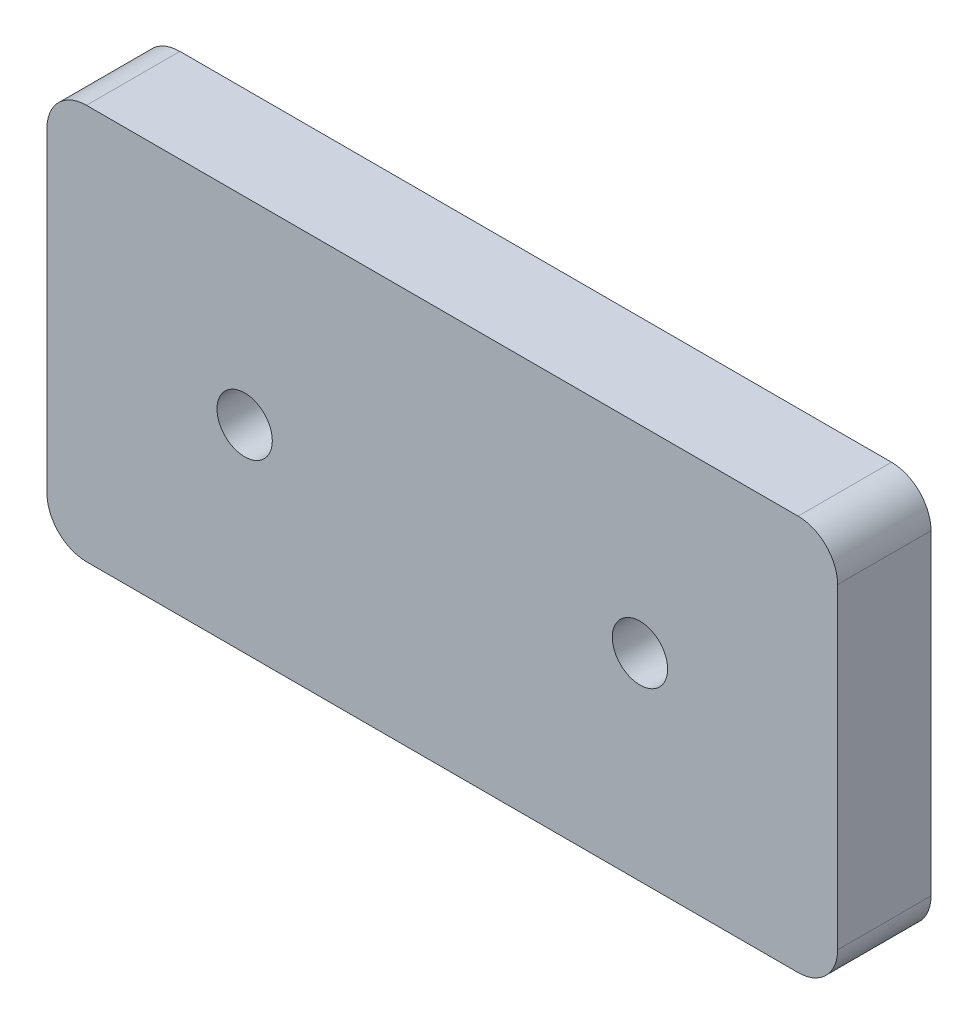
ISO-10303-21;
HEADER;
FILE_DESCRIPTION(('STEP AP214'),'2;1');
FILE_NAME('part.step','',(''),(''),'','','');
FILE_SCHEMA(('AUTOMOTIVE_DESIGN { 1 0 10303 214 1 1 1 1 }'));
ENDSEC;
DATA;
#1=APPLICATION_CONTEXT('core data for automotive mechanical design processes');
#2=APPLICATION_PROTOCOL_DEFINITION('international standard','automotive_design',2000,#1);
#3=PRODUCT_CONTEXT('',#1,'mechanical');
#4=PRODUCT('Part','Part','',(#3));
#5=PRODUCT_RELATED_PRODUCT_CATEGORY('part','',(#4));
#6=PRODUCT_DEFINITION_FORMATION('','',#4);
#7=PRODUCT_DEFINITION_CONTEXT('part definition',#1,'design');
#8=PRODUCT_DEFINITION('design','',#6,#7);
#9=PRODUCT_DEFINITION_SHAPE('','',#8);
#10=(LENGTH_UNIT() NAMED_UNIT(*) SI_UNIT(.MILLI.,.METRE.));
#11=(NAMED_UNIT(*) PLANE_ANGLE_UNIT() SI_UNIT($,.RADIAN.));
#12=(NAMED_UNIT(*) SI_UNIT($,.STERADIAN.) SOLID_ANGLE_UNIT());
#13=UNCERTAINTY_MEASURE_WITH_UNIT(LENGTH_MEASURE(1.E-05),#10,'distance_accuracy_value','');
#14=(GEOMETRIC_REPRESENTATION_CONTEXT(3) GLOBAL_UNCERTAINTY_ASSIGNED_CONTEXT((#13)) GLOBAL_UNIT_ASSIGNED_CONTEXT((#10,
#11,#12)) REPRESENTATION_CONTEXT('',''));
#15=CARTESIAN_POINT('',(0.,0.,0.));
#16=DIRECTION('',(0.,0.,1.));
#17=DIRECTION('',(1.,0.,0.));
#18=AXIS2_PLACEMENT_3D('',#15,#16,#17);
#19=CARTESIAN_POINT('',(25.4,-10.16,0.));
#20=DIRECTION('',(-1.,0.,0.));
#21=DIRECTION('',(0.,0.,1.));
#22=AXIS2_PLACEMENT_3D('',#19,#20,#21);
#23=PLANE('',#22);
#24=DIRECTION('',(0.,0.,1.));
#25=VECTOR('',#24,1.);
#26=CARTESIAN_POINT('',(25.4,-10.1600000010419,3.));
#27=LINE('',#26,#25);
#28=CARTESIAN_POINT('',(25.4,-10.160000000521,6.));
#29=VERTEX_POINT('',#28);
#30=CARTESIAN_POINT('',(25.4,-10.160000000521,0.));
#31=VERTEX_POINT('',#30);
#32=EDGE_CURVE('E111',#29,#31,#27,.F.);
#33=ORIENTED_EDGE('',*,*,#32,.T.);
#34=DIRECTION('',(0.,1.,0.));
#35=VECTOR('',#34,1.);
#36=CARTESIAN_POINT('',(25.4,0.,0.));
#37=LINE('',#36,#35);
#38=CARTESIAN_POINT('',(25.4,10.159999999479,0.));
#39=VERTEX_POINT('',#38);
#40=EDGE_CURVE('E106',#31,#39,#37,.T.);
#41=ORIENTED_EDGE('',*,*,#40,.T.);
#42=DIRECTION('',(0.,0.,-1.));
#43=VECTOR('',#42,1.);
#44=CARTESIAN_POINT('',(25.4,10.1599999989581,3.));
#45=LINE('',#44,#43);
#46=CARTESIAN_POINT('',(25.4,10.159999999479,6.));
#47=VERTEX_POINT('',#46);
#48=EDGE_CURVE('E81',#39,#47,#45,.F.);
#49=ORIENTED_EDGE('',*,*,#48,.T.);
#50=DIRECTION('',(0.,1.,0.));
#51=VECTOR('',#50,1.);
#52=CARTESIAN_POINT('',(25.4,0.,6.));
#53=LINE('',#52,#51);
#54=EDGE_CURVE('E141',#29,#47,#53,.T.);
#55=ORIENTED_EDGE('',*,*,#54,.F.);
#56=EDGE_LOOP('',(#33,#41,#49,#55));
#57=FACE_BOUND('',#56,.T.);
#58=ADVANCED_FACE('F17',(#57),#23,.F.);
#59=CARTESIAN_POINT('',(22.86,10.16,6.));
#60=DIRECTION('',(0.,0.,-1.));
#61=DIRECTION('',(-1.,0.,0.));
#62=AXIS2_PLACEMENT_3D('',#59,#60,#61);
#63=CYLINDRICAL_SURFACE('',#62,2.54);
#64=CARTESIAN_POINT('',(22.86,10.16,0.));
#65=DIRECTION('',(0.,0.,-1.));
#66=DIRECTION('',(-1.,0.,0.));
#67=AXIS2_PLACEMENT_3D('',#64,#65,#66);
#68=CIRCLE('',#67,2.54);
#69=CARTESIAN_POINT('',(22.86,12.7,0.));
#70=VERTEX_POINT('',#69);
#71=EDGE_CURVE('E21',#39,#70,#68,.F.);
#72=ORIENTED_EDGE('',*,*,#71,.T.);
#73=DIRECTION('',(0.,0.,1.));
#74=VECTOR('',#73,1.);
#75=CARTESIAN_POINT('',(22.86,12.7,3.));
#76=LINE('',#75,#74);
#77=CARTESIAN_POINT('',(22.86,12.7,6.));
#78=VERTEX_POINT('',#77);
#79=EDGE_CURVE('E88',#70,#78,#76,.T.);
#80=ORIENTED_EDGE('',*,*,#79,.T.);
#81=CARTESIAN_POINT('',(22.86,10.16,6.));
#82=DIRECTION('',(0.,0.,-1.));
#83=DIRECTION('',(-1.,0.,0.));
#84=AXIS2_PLACEMENT_3D('',#81,#82,#83);
#85=CIRCLE('',#84,2.54);
#86=EDGE_CURVE('E139',#47,#78,#85,.F.);
#87=ORIENTED_EDGE('',*,*,#86,.F.);
#88=ORIENTED_EDGE('',*,*,#48,.F.);
#89=EDGE_LOOP('',(#72,#80,#87,#88));
#90=FACE_BOUND('',#89,.T.);
#91=ADVANCED_FACE('F105',(#90),#63,.T.);
#92=CARTESIAN_POINT('',(-22.86,12.7,0.));
#93=DIRECTION('',(0.,-1.,0.));
#94=DIRECTION('',(1.,0.,0.));
#95=AXIS2_PLACEMENT_3D('',#92,#93,#94);
#96=PLANE('',#95);
#97=ORIENTED_EDGE('',*,*,#79,.F.);
#98=DIRECTION('',(-1.,0.,0.));
#99=VECTOR('',#98,1.);
#100=CARTESIAN_POINT('',(0.,12.7,0.));
#101=LINE('',#100,#99);
#102=CARTESIAN_POINT('',(-22.8599999997395,12.7,0.));
#103=VERTEX_POINT('',#102);
#104=EDGE_CURVE('E92',#70,#103,#101,.T.);
#105=ORIENTED_EDGE('',*,*,#104,.T.);
#106=DIRECTION('',(0.,0.,-1.));
#107=VECTOR('',#106,1.);
#108=CARTESIAN_POINT('',(-22.859999999479,12.7,3.));
#109=LINE('',#108,#107);
#110=CARTESIAN_POINT('',(-22.8599999997395,12.7,6.));
#111=VERTEX_POINT('',#110);
#112=EDGE_CURVE('E94',#103,#111,#109,.F.);
#113=ORIENTED_EDGE('',*,*,#112,.T.);
#114=DIRECTION('',(-1.,0.,0.));
#115=VECTOR('',#114,1.);
#116=CARTESIAN_POINT('',(0.,12.7,6.));
#117=LINE('',#116,#115);
#118=EDGE_CURVE('E93',#78,#111,#117,.T.);
#119=ORIENTED_EDGE('',*,*,#118,.F.);
#120=EDGE_LOOP('',(#97,#105,#113,#119));
#121=FACE_BOUND('',#120,.T.);
#122=ADVANCED_FACE('F90',(#121),#96,.F.);
#123=CARTESIAN_POINT('',(-22.86,10.16,6.));
#124=DIRECTION('',(0.,0.,-1.));
#125=DIRECTION('',(-1.,0.,0.));
#126=AXIS2_PLACEMENT_3D('',#123,#124,#125);
#127=CYLINDRICAL_SURFACE('',#126,2.54);
#128=CARTESIAN_POINT('',(-22.86,10.16,0.));
#129=DIRECTION('',(0.,0.,-1.));
#130=DIRECTION('',(-1.,0.,0.));
#131=AXIS2_PLACEMENT_3D('',#128,#129,#130);
#132=CIRCLE('',#131,2.54);
#133=CARTESIAN_POINT('',(-25.4,10.16,0.));
#134=VERTEX_POINT('',#133);
#135=EDGE_CURVE('E103',#103,#134,#132,.F.);
#136=ORIENTED_EDGE('',*,*,#135,.T.);
#137=DIRECTION('',(0.,0.,1.));
#138=VECTOR('',#137,1.);
#139=CARTESIAN_POINT('',(-25.4,10.16,3.));
#140=LINE('',#139,#138);
#141=CARTESIAN_POINT('',(-25.4,10.16,6.));
#142=VERTEX_POINT('',#141);
#143=EDGE_CURVE('E122',#134,#142,#140,.T.);
#144=ORIENTED_EDGE('',*,*,#143,.T.);
#145=CARTESIAN_POINT('',(-22.86,10.16,6.));
#146=DIRECTION('',(0.,0.,-1.));
#147=DIRECTION('',(-1.,0.,0.));
#148=AXIS2_PLACEMENT_3D('',#145,#146,#147);
#149=CIRCLE('',#148,2.54);
#150=EDGE_CURVE('E137',#111,#142,#149,.F.);
#151=ORIENTED_EDGE('',*,*,#150,.F.);
#152=ORIENTED_EDGE('',*,*,#112,.F.);
#153=EDGE_LOOP('',(#136,#144,#151,#152));
#154=FACE_BOUND('',#153,.T.);
#155=ADVANCED_FACE('F175',(#154),#127,.T.);
#156=CARTESIAN_POINT('',(-25.4,-10.16,6.));
#157=DIRECTION('',(1.,0.,0.));
#158=DIRECTION('',(0.,0.,-1.));
#159=AXIS2_PLACEMENT_3D('',#156,#157,#158);
#160=PLANE('',#159);
#161=ORIENTED_EDGE('',*,*,#143,.F.);
#162=DIRECTION('',(0.,-1.,0.));
#163=VECTOR('',#162,1.);
#164=CARTESIAN_POINT('',(-25.4,0.,0.));
#165=LINE('',#164,#163);
#166=CARTESIAN_POINT('',(-25.4,-10.1600000002281,0.));
#167=VERTEX_POINT('',#166);
#168=EDGE_CURVE('E151',#134,#167,#165,.T.);
#169=ORIENTED_EDGE('',*,*,#168,.T.);
#170=DIRECTION('',(0.,0.,-1.));
#171=VECTOR('',#170,1.);
#172=CARTESIAN_POINT('',(-25.4,-10.1600000004562,3.));
#173=LINE('',#172,#171);
#174=CARTESIAN_POINT('',(-25.4,-10.1600000002281,6.));
#175=VERTEX_POINT('',#174);
#176=EDGE_CURVE('E119',#167,#175,#173,.F.);
#177=ORIENTED_EDGE('',*,*,#176,.T.);
#178=DIRECTION('',(0.,-1.,0.));
#179=VECTOR('',#178,1.);
#180=CARTESIAN_POINT('',(-25.4,0.,6.));
#181=LINE('',#180,#179);
#182=EDGE_CURVE('E136',#142,#175,#181,.T.);
#183=ORIENTED_EDGE('',*,*,#182,.F.);
#184=EDGE_LOOP('',(#161,#169,#177,#183));
#185=FACE_BOUND('',#184,.T.);
#186=ADVANCED_FACE('F164',(#185),#160,.F.);
#187=CARTESIAN_POINT('',(-22.86,-10.16,6.));
#188=DIRECTION('',(0.,0.,-1.));
#189=DIRECTION('',(-1.,0.,0.));
#190=AXIS2_PLACEMENT_3D('',#187,#188,#189);
#191=CYLINDRICAL_SURFACE('',#190,2.54);
#192=CARTESIAN_POINT('',(-22.86,-10.16,0.));
#193=DIRECTION('',(0.,0.,-1.));
#194=DIRECTION('',(-1.,0.,0.));
#195=AXIS2_PLACEMENT_3D('',#192,#193,#194);
#196=CIRCLE('',#195,2.54);
#197=CARTESIAN_POINT('',(-22.86,-12.7,0.));
#198=VERTEX_POINT('',#197);
#199=EDGE_CURVE('E149',#167,#198,#196,.F.);
#200=ORIENTED_EDGE('',*,*,#199,.T.);
#201=DIRECTION('',(0.,0.,1.));
#202=VECTOR('',#201,1.);
#203=CARTESIAN_POINT('',(-22.86,-12.7,3.));
#204=LINE('',#203,#202);
#205=CARTESIAN_POINT('',(-22.86,-12.7,6.));
#206=VERTEX_POINT('',#205);
#207=EDGE_CURVE('E116',#198,#206,#204,.T.);
#208=ORIENTED_EDGE('',*,*,#207,.T.);
#209=CARTESIAN_POINT('',(-22.86,-10.16,6.));
#210=DIRECTION('',(0.,0.,-1.));
#211=DIRECTION('',(-1.,0.,0.));
#212=AXIS2_PLACEMENT_3D('',#209,#210,#211);
#213=CIRCLE('',#212,2.54);
#214=EDGE_CURVE('E134',#175,#206,#213,.F.);
#215=ORIENTED_EDGE('',*,*,#214,.F.);
#216=ORIENTED_EDGE('',*,*,#176,.F.);
#217=EDGE_LOOP('',(#200,#208,#215,#216));
#218=FACE_BOUND('',#217,.T.);
#219=ADVANCED_FACE('F167',(#218),#191,.T.);
#220=CARTESIAN_POINT('',(22.86,-12.7,0.));
#221=DIRECTION('',(0.,1.,0.));
#222=DIRECTION('',(-1.,0.,0.));
#223=AXIS2_PLACEMENT_3D('',#220,#221,#222);
#224=PLANE('',#223);
#225=ORIENTED_EDGE('',*,*,#207,.F.);
#226=DIRECTION('',(1.,0.,0.));
#227=VECTOR('',#226,1.);
#228=CARTESIAN_POINT('',(0.,-12.7,0.));
#229=LINE('',#228,#227);
#230=CARTESIAN_POINT('',(22.8600000004886,-12.7,0.));
#231=VERTEX_POINT('',#230);
#232=EDGE_CURVE('E148',#198,#231,#229,.T.);
#233=ORIENTED_EDGE('',*,*,#232,.T.);
#234=DIRECTION('',(0.,0.,-1.));
#235=VECTOR('',#234,1.);
#236=CARTESIAN_POINT('',(22.8600000009771,-12.7,3.));
#237=LINE('',#236,#235);
#238=CARTESIAN_POINT('',(22.8600000004886,-12.7,6.));
#239=VERTEX_POINT('',#238);
#240=EDGE_CURVE('E107',#231,#239,#237,.F.);
#241=ORIENTED_EDGE('',*,*,#240,.T.);
#242=DIRECTION('',(1.,0.,0.));
#243=VECTOR('',#242,1.);
#244=CARTESIAN_POINT('',(0.,-12.7,6.));
#245=LINE('',#244,#243);
#246=EDGE_CURVE('E36',#206,#239,#245,.T.);
#247=ORIENTED_EDGE('',*,*,#246,.F.);
#248=EDGE_LOOP('',(#225,#233,#241,#247));
#249=FACE_BOUND('',#248,.T.);
#250=ADVANCED_FACE('F169',(#249),#224,.F.);
#251=CARTESIAN_POINT('',(22.86,-10.16,6.));
#252=DIRECTION('',(0.,0.,-1.));
#253=DIRECTION('',(-1.,0.,0.));
#254=AXIS2_PLACEMENT_3D('',#251,#252,#253);
#255=CYLINDRICAL_SURFACE('',#254,2.54);
#256=CARTESIAN_POINT('',(22.86,-10.16,0.));
#257=DIRECTION('',(0.,0.,-1.));
#258=DIRECTION('',(-1.,0.,0.));
#259=AXIS2_PLACEMENT_3D('',#256,#257,#258);
#260=CIRCLE('',#259,2.54);
#261=EDGE_CURVE('E145',#231,#31,#260,.F.);
#262=ORIENTED_EDGE('',*,*,#261,.T.);
#263=ORIENTED_EDGE('',*,*,#32,.F.);
#264=CARTESIAN_POINT('',(22.86,-10.16,6.));
#265=DIRECTION('',(0.,0.,-1.));
#266=DIRECTION('',(-1.,0.,0.));
#267=AXIS2_PLACEMENT_3D('',#264,#265,#266);
#268=CIRCLE('',#267,2.54);
#269=EDGE_CURVE('E132',#239,#29,#268,.F.);
#270=ORIENTED_EDGE('',*,*,#269,.F.);
#271=ORIENTED_EDGE('',*,*,#240,.F.);
#272=EDGE_LOOP('',(#262,#263,#270,#271));
#273=FACE_BOUND('',#272,.T.);
#274=ADVANCED_FACE('F173',(#273),#255,.T.);
#275=CARTESIAN_POINT('',(12.7,0.,0.));
#276=DIRECTION('',(0.,0.,1.));
#277=DIRECTION('',(1.,0.,0.));
#278=AXIS2_PLACEMENT_3D('',#275,#276,#277);
#279=CYLINDRICAL_SURFACE('',#278,1.778);
#280=CARTESIAN_POINT('',(12.7,0.,0.));
#281=DIRECTION('',(0.,0.,1.));
#282=DIRECTION('',(1.,0.,0.));
#283=AXIS2_PLACEMENT_3D('',#280,#281,#282);
#284=CIRCLE('',#283,1.778);
#285=CARTESIAN_POINT('',(14.478,0.,0.));
#286=VERTEX_POINT('',#285);
#287=EDGE_CURVE('E142',#286,#286,#284,.F.);
#288=ORIENTED_EDGE('',*,*,#287,.T.);
#289=EDGE_LOOP('',(#288));
#290=FACE_BOUND('',#289,.T.);
#291=CARTESIAN_POINT('',(12.7,0.,6.));
#292=DIRECTION('',(0.,0.,1.));
#293=DIRECTION('',(1.,0.,0.));
#294=AXIS2_PLACEMENT_3D('',#291,#292,#293);
#295=CIRCLE('',#294,1.778);
#296=CARTESIAN_POINT('',(14.478,0.,6.));
#297=VERTEX_POINT('',#296);
#298=EDGE_CURVE('E129',#297,#297,#295,.F.);
#299=ORIENTED_EDGE('',*,*,#298,.F.);
#300=EDGE_LOOP('',(#299));
#301=FACE_BOUND('',#300,.T.);
#302=ADVANCED_FACE('F197',(#290,#301),#279,.F.);
#303=CARTESIAN_POINT('',(-25.4,-12.7,0.));
#304=DIRECTION('',(0.,0.,1.));
#305=DIRECTION('',(1.,0.,0.));
#306=AXIS2_PLACEMENT_3D('',#303,#304,#305);
#307=PLANE('',#306);
#308=ORIENTED_EDGE('',*,*,#287,.F.);
#309=EDGE_LOOP('',(#308));
#310=FACE_BOUND('',#309,.T.);
#311=CARTESIAN_POINT('',(-12.7,0.,0.));
#312=DIRECTION('',(0.,0.,1.));
#313=DIRECTION('',(1.,0.,0.));
#314=AXIS2_PLACEMENT_3D('',#311,#312,#313);
#315=CIRCLE('',#314,1.778);
#316=CARTESIAN_POINT('',(-10.922,0.,0.));
#317=VERTEX_POINT('',#316);
#318=EDGE_CURVE('E27',#317,#317,#315,.F.);
#319=ORIENTED_EDGE('',*,*,#318,.F.);
#320=EDGE_LOOP('',(#319));
#321=FACE_BOUND('',#320,.T.);
#322=ORIENTED_EDGE('',*,*,#232,.F.);
#323=ORIENTED_EDGE('',*,*,#199,.F.);
#324=ORIENTED_EDGE('',*,*,#168,.F.);
#325=ORIENTED_EDGE('',*,*,#135,.F.);
#326=ORIENTED_EDGE('',*,*,#104,.F.);
#327=ORIENTED_EDGE('',*,*,#71,.F.);
#328=ORIENTED_EDGE('',*,*,#40,.F.);
#329=ORIENTED_EDGE('',*,*,#261,.F.);
#330=EDGE_LOOP('',(#322,#323,#324,#325,#326,#327,#328,#329));
#331=FACE_BOUND('',#330,.T.);
#332=ADVANCED_FACE('F99',(#310,#321,#331),#307,.F.);
#333=CARTESIAN_POINT('',(-25.4,-12.7,6.));
#334=DIRECTION('',(0.,0.,1.));
#335=DIRECTION('',(1.,0.,0.));
#336=AXIS2_PLACEMENT_3D('',#333,#334,#335);
#337=PLANE('',#336);
#338=ORIENTED_EDGE('',*,*,#298,.T.);
#339=EDGE_LOOP('',(#338));
#340=FACE_BOUND('',#339,.T.);
#341=CARTESIAN_POINT('',(-12.7,0.,6.));
#342=DIRECTION('',(0.,0.,1.));
#343=DIRECTION('',(1.,0.,0.));
#344=AXIS2_PLACEMENT_3D('',#341,#342,#343);
#345=CIRCLE('',#344,1.778);
#346=CARTESIAN_POINT('',(-10.922,0.,6.));
#347=VERTEX_POINT('',#346);
#348=EDGE_CURVE('E11',#347,#347,#345,.T.);
#349=ORIENTED_EDGE('',*,*,#348,.F.);
#350=EDGE_LOOP('',(#349));
#351=FACE_BOUND('',#350,.T.);
#352=ORIENTED_EDGE('',*,*,#246,.T.);
#353=ORIENTED_EDGE('',*,*,#269,.T.);
#354=ORIENTED_EDGE('',*,*,#54,.T.);
#355=ORIENTED_EDGE('',*,*,#86,.T.);
#356=ORIENTED_EDGE('',*,*,#118,.T.);
#357=ORIENTED_EDGE('',*,*,#150,.T.);
#358=ORIENTED_EDGE('',*,*,#182,.T.);
#359=ORIENTED_EDGE('',*,*,#214,.T.);
#360=EDGE_LOOP('',(#352,#353,#354,#355,#356,#357,#358,#359));
#361=FACE_BOUND('',#360,.T.);
#362=ADVANCED_FACE('F19',(#340,#351,#361),#337,.T.);
#363=CARTESIAN_POINT('',(-12.7,0.,0.));
#364=DIRECTION('',(0.,0.,1.));
#365=DIRECTION('',(1.,0.,0.));
#366=AXIS2_PLACEMENT_3D('',#363,#364,#365);
#367=CYLINDRICAL_SURFACE('',#366,1.778);
#368=ORIENTED_EDGE('',*,*,#348,.T.);
#369=EDGE_LOOP('',(#368));
#370=FACE_BOUND('',#369,.T.);
#371=ORIENTED_EDGE('',*,*,#318,.T.);
#372=EDGE_LOOP('',(#371));
#373=FACE_BOUND('',#372,.T.);
#374=ADVANCED_FACE('F187',(#370,#373),#367,.F.);
#375=CLOSED_SHELL('',(#58,#91,#122,#155,#186,#219,#250,#274,#302,#332,#362,#374));
#376=MANIFOLD_SOLID_BREP('B1',#375);
#377=ADVANCED_BREP_SHAPE_REPRESENTATION('',(#18,#376),#14);
#378=SHAPE_DEFINITION_REPRESENTATION(#9,#377);
ENDSEC;
END-ISO-10303-21;
